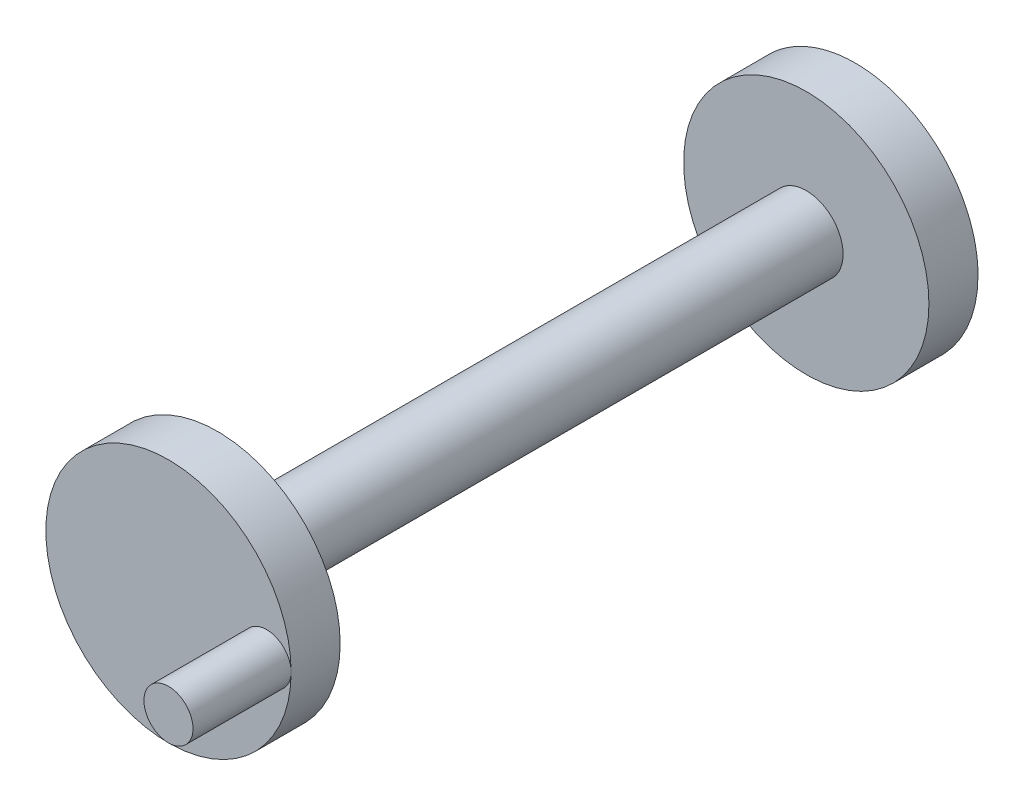
ISO-10303-21;
HEADER;
FILE_DESCRIPTION(('STEP AP214'),'2;1');
FILE_NAME('part.step','',(''),(''),'','','');
FILE_SCHEMA(('AUTOMOTIVE_DESIGN { 1 0 10303 214 1 1 1 1 }'));
ENDSEC;
DATA;
#1=APPLICATION_CONTEXT('core data for automotive mechanical design processes');
#2=APPLICATION_PROTOCOL_DEFINITION('international standard','automotive_design',2000,#1);
#3=PRODUCT_CONTEXT('',#1,'mechanical');
#4=PRODUCT('Part','Part','',(#3));
#5=PRODUCT_RELATED_PRODUCT_CATEGORY('part','',(#4));
#6=PRODUCT_DEFINITION_FORMATION('','',#4);
#7=PRODUCT_DEFINITION_CONTEXT('part definition',#1,'design');
#8=PRODUCT_DEFINITION('design','',#6,#7);
#9=PRODUCT_DEFINITION_SHAPE('','',#8);
#10=(LENGTH_UNIT() NAMED_UNIT(*) SI_UNIT(.MILLI.,.METRE.));
#11=(NAMED_UNIT(*) PLANE_ANGLE_UNIT() SI_UNIT($,.RADIAN.));
#12=(NAMED_UNIT(*) SI_UNIT($,.STERADIAN.) SOLID_ANGLE_UNIT());
#13=UNCERTAINTY_MEASURE_WITH_UNIT(LENGTH_MEASURE(1.E-05),#10,'distance_accuracy_value','');
#14=(GEOMETRIC_REPRESENTATION_CONTEXT(3) GLOBAL_UNCERTAINTY_ASSIGNED_CONTEXT((#13)) GLOBAL_UNIT_ASSIGNED_CONTEXT((#10,
#11,#12)) REPRESENTATION_CONTEXT('',''));
#15=CARTESIAN_POINT('',(0.,0.,0.));
#16=DIRECTION('',(0.,0.,1.));
#17=DIRECTION('',(1.,0.,0.));
#18=AXIS2_PLACEMENT_3D('',#15,#16,#17);
#19=CARTESIAN_POINT('',(0.,0.,1.));
#20=DIRECTION('',(0.,0.,-1.));
#21=DIRECTION('',(-1.,0.,0.));
#22=AXIS2_PLACEMENT_3D('',#19,#20,#21);
#23=CYLINDRICAL_SURFACE('',#22,2.5);
#24=CARTESIAN_POINT('',(0.,0.,1.));
#25=DIRECTION('',(0.,0.,1.));
#26=DIRECTION('',(1.,0.,0.));
#27=AXIS2_PLACEMENT_3D('',#24,#25,#26);
#28=CIRCLE('',#27,2.5);
#29=CARTESIAN_POINT('',(2.5,0.,1.));
#30=VERTEX_POINT('',#29);
#31=EDGE_CURVE('E12',#30,#30,#28,.T.);
#32=ORIENTED_EDGE('',*,*,#31,.F.);
#33=EDGE_LOOP('',(#32));
#34=FACE_BOUND('',#33,.T.);
#35=CARTESIAN_POINT('',(0.,0.,0.));
#36=DIRECTION('',(0.,0.,1.));
#37=DIRECTION('',(1.,0.,0.));
#38=AXIS2_PLACEMENT_3D('',#35,#36,#37);
#39=CIRCLE('',#38,2.5);
#40=CARTESIAN_POINT('',(2.5,0.,0.));
#41=VERTEX_POINT('',#40);
#42=EDGE_CURVE('E48',#41,#41,#39,.T.);
#43=ORIENTED_EDGE('',*,*,#42,.T.);
#44=EDGE_LOOP('',(#43));
#45=FACE_BOUND('',#44,.T.);
#46=ADVANCED_FACE('F45',(#34,#45),#23,.T.);
#47=CARTESIAN_POINT('',(0.,0.,1.));
#48=DIRECTION('',(0.,0.,1.));
#49=DIRECTION('',(1.,0.,0.));
#50=AXIS2_PLACEMENT_3D('',#47,#48,#49);
#51=PLANE('',#50);
#52=ORIENTED_EDGE('',*,*,#31,.T.);
#53=CARTESIAN_POINT('',(2.,0.,1.));
#54=DIRECTION('',(0.,0.,1.));
#55=DIRECTION('',(1.,0.,0.));
#56=AXIS2_PLACEMENT_3D('',#53,#54,#55);
#57=CIRCLE('',#56,0.5);
#58=EDGE_CURVE('E65',#30,#30,#57,.T.);
#59=ORIENTED_EDGE('',*,*,#58,.F.);
#60=EDGE_LOOP('',(#52,#59));
#61=FACE_BOUND('',#60,.T.);
#62=ADVANCED_FACE('F63',(#61),#51,.T.);
#63=CARTESIAN_POINT('',(0.,0.,0.));
#64=DIRECTION('',(0.,0.,1.));
#65=DIRECTION('',(1.,0.,0.));
#66=AXIS2_PLACEMENT_3D('',#63,#64,#65);
#67=PLANE('',#66);
#68=CARTESIAN_POINT('',(0.,0.,0.));
#69=DIRECTION('',(0.,0.,1.));
#70=DIRECTION('',(1.,0.,0.));
#71=AXIS2_PLACEMENT_3D('',#68,#69,#70);
#72=CIRCLE('',#71,0.75);
#73=CARTESIAN_POINT('',(0.75,0.,0.));
#74=VERTEX_POINT('',#73);
#75=EDGE_CURVE('E71',#74,#74,#72,.T.);
#76=ORIENTED_EDGE('',*,*,#75,.T.);
#77=EDGE_LOOP('',(#76));
#78=FACE_BOUND('',#77,.T.);
#79=ORIENTED_EDGE('',*,*,#42,.F.);
#80=EDGE_LOOP('',(#79));
#81=FACE_BOUND('',#80,.T.);
#82=ADVANCED_FACE('F84',(#78,#81),#67,.F.);
#83=CARTESIAN_POINT('',(0.,0.,-12.));
#84=DIRECTION('',(0.,0.,1.));
#85=DIRECTION('',(1.,0.,0.));
#86=AXIS2_PLACEMENT_3D('',#83,#84,#85);
#87=CYLINDRICAL_SURFACE('',#86,0.75);
#88=ORIENTED_EDGE('',*,*,#75,.F.);
#89=EDGE_LOOP('',(#88));
#90=FACE_BOUND('',#89,.T.);
#91=CARTESIAN_POINT('',(0.,0.,-12.));
#92=DIRECTION('',(0.,0.,1.));
#93=DIRECTION('',(1.,0.,0.));
#94=AXIS2_PLACEMENT_3D('',#91,#92,#93);
#95=CIRCLE('',#94,0.75);
#96=CARTESIAN_POINT('',(0.75,0.,-12.));
#97=VERTEX_POINT('',#96);
#98=EDGE_CURVE('E68',#97,#97,#95,.T.);
#99=ORIENTED_EDGE('',*,*,#98,.T.);
#100=EDGE_LOOP('',(#99));
#101=FACE_BOUND('',#100,.T.);
#102=ADVANCED_FACE('F86',(#90,#101),#87,.T.);
#103=CARTESIAN_POINT('',(2.,0.,3.));
#104=DIRECTION('',(0.,0.,-1.));
#105=DIRECTION('',(-1.,0.,0.));
#106=AXIS2_PLACEMENT_3D('',#103,#104,#105);
#107=CYLINDRICAL_SURFACE('',#106,0.5);
#108=CARTESIAN_POINT('',(2.,0.,3.));
#109=DIRECTION('',(0.,0.,1.));
#110=DIRECTION('',(1.,0.,0.));
#111=AXIS2_PLACEMENT_3D('',#108,#109,#110);
#112=CIRCLE('',#111,0.5);
#113=CARTESIAN_POINT('',(2.5,0.,3.));
#114=VERTEX_POINT('',#113);
#115=EDGE_CURVE('E67',#114,#114,#112,.T.);
#116=ORIENTED_EDGE('',*,*,#115,.F.);
#117=EDGE_LOOP('',(#116));
#118=FACE_BOUND('',#117,.T.);
#119=ORIENTED_EDGE('',*,*,#58,.T.);
#120=EDGE_LOOP('',(#119));
#121=FACE_BOUND('',#120,.T.);
#122=ADVANCED_FACE('F91',(#118,#121),#107,.T.);
#123=CARTESIAN_POINT('',(2.,0.,3.));
#124=DIRECTION('',(0.,0.,1.));
#125=DIRECTION('',(1.,0.,0.));
#126=AXIS2_PLACEMENT_3D('',#123,#124,#125);
#127=PLANE('',#126);
#128=ORIENTED_EDGE('',*,*,#115,.T.);
#129=EDGE_LOOP('',(#128));
#130=FACE_BOUND('',#129,.T.);
#131=ADVANCED_FACE('F113',(#130),#127,.T.);
#132=CARTESIAN_POINT('',(0.,0.,-13.));
#133=DIRECTION('',(0.,0.,1.));
#134=DIRECTION('',(1.,0.,0.));
#135=AXIS2_PLACEMENT_3D('',#132,#133,#134);
#136=CYLINDRICAL_SURFACE('',#135,2.5);
#137=CARTESIAN_POINT('',(0.,0.,-13.));
#138=DIRECTION('',(0.,0.,1.));
#139=DIRECTION('',(1.,0.,0.));
#140=AXIS2_PLACEMENT_3D('',#137,#138,#139);
#141=CIRCLE('',#140,2.5);
#142=CARTESIAN_POINT('',(-2.5,0.,-13.));
#143=VERTEX_POINT('',#142);
#144=EDGE_CURVE('E74',#143,#143,#141,.T.);
#145=ORIENTED_EDGE('',*,*,#144,.T.);
#146=EDGE_LOOP('',(#145));
#147=FACE_BOUND('',#146,.T.);
#148=CARTESIAN_POINT('',(0.,0.,-12.));
#149=DIRECTION('',(0.,0.,1.));
#150=DIRECTION('',(1.,0.,0.));
#151=AXIS2_PLACEMENT_3D('',#148,#149,#150);
#152=CIRCLE('',#151,2.5);
#153=CARTESIAN_POINT('',(2.5,0.,-12.));
#154=VERTEX_POINT('',#153);
#155=EDGE_CURVE('E181',#154,#154,#152,.T.);
#156=ORIENTED_EDGE('',*,*,#155,.F.);
#157=EDGE_LOOP('',(#156));
#158=FACE_BOUND('',#157,.T.);
#159=ADVANCED_FACE('F124',(#147,#158),#136,.T.);
#160=CARTESIAN_POINT('',(0.,0.,-13.));
#161=DIRECTION('',(0.,0.,1.));
#162=DIRECTION('',(1.,0.,0.));
#163=AXIS2_PLACEMENT_3D('',#160,#161,#162);
#164=PLANE('',#163);
#165=ORIENTED_EDGE('',*,*,#144,.F.);
#166=CARTESIAN_POINT('',(-2.,0.,-13.));
#167=DIRECTION('',(0.,0.,1.));
#168=DIRECTION('',(1.,0.,0.));
#169=AXIS2_PLACEMENT_3D('',#166,#167,#168);
#170=CIRCLE('',#169,0.5);
#171=EDGE_CURVE('E57',#143,#143,#170,.T.);
#172=ORIENTED_EDGE('',*,*,#171,.T.);
#173=EDGE_LOOP('',(#165,#172));
#174=FACE_BOUND('',#173,.T.);
#175=ADVANCED_FACE('F138',(#174),#164,.F.);
#176=CARTESIAN_POINT('',(0.,0.,-12.));
#177=DIRECTION('',(0.,0.,1.));
#178=DIRECTION('',(1.,0.,0.));
#179=AXIS2_PLACEMENT_3D('',#176,#177,#178);
#180=PLANE('',#179);
#181=ORIENTED_EDGE('',*,*,#98,.F.);
#182=EDGE_LOOP('',(#181));
#183=FACE_BOUND('',#182,.T.);
#184=ORIENTED_EDGE('',*,*,#155,.T.);
#185=EDGE_LOOP('',(#184));
#186=FACE_BOUND('',#185,.T.);
#187=ADVANCED_FACE('F132',(#183,#186),#180,.T.);
#188=CARTESIAN_POINT('',(-2.,0.,-15.));
#189=DIRECTION('',(0.,0.,1.));
#190=DIRECTION('',(1.,0.,0.));
#191=AXIS2_PLACEMENT_3D('',#188,#189,#190);
#192=CYLINDRICAL_SURFACE('',#191,0.5);
#193=CARTESIAN_POINT('',(-2.,0.,-15.));
#194=DIRECTION('',(0.,0.,1.));
#195=DIRECTION('',(1.,0.,0.));
#196=AXIS2_PLACEMENT_3D('',#193,#194,#195);
#197=CIRCLE('',#196,0.5);
#198=CARTESIAN_POINT('',(-1.5,0.,-15.));
#199=VERTEX_POINT('',#198);
#200=EDGE_CURVE('E180',#199,#199,#197,.T.);
#201=ORIENTED_EDGE('',*,*,#200,.T.);
#202=EDGE_LOOP('',(#201));
#203=FACE_BOUND('',#202,.T.);
#204=ORIENTED_EDGE('',*,*,#171,.F.);
#205=EDGE_LOOP('',(#204));
#206=FACE_BOUND('',#205,.T.);
#207=ADVANCED_FACE('F137',(#203,#206),#192,.T.);
#208=CARTESIAN_POINT('',(-2.,0.,-15.));
#209=DIRECTION('',(0.,0.,1.));
#210=DIRECTION('',(1.,0.,0.));
#211=AXIS2_PLACEMENT_3D('',#208,#209,#210);
#212=PLANE('',#211);
#213=ORIENTED_EDGE('',*,*,#200,.F.);
#214=EDGE_LOOP('',(#213));
#215=FACE_BOUND('',#214,.T.);
#216=ADVANCED_FACE('F164',(#215),#212,.F.);
#217=CLOSED_SHELL('',(#46,#62,#82,#102,#122,#131,#159,#175,#187,#207,#216));
#218=MANIFOLD_SOLID_BREP('B2',#217);
#219=ADVANCED_BREP_SHAPE_REPRESENTATION('',(#18,#218),#14);
#220=SHAPE_DEFINITION_REPRESENTATION(#9,#219);
ENDSEC;
END-ISO-10303-21;
